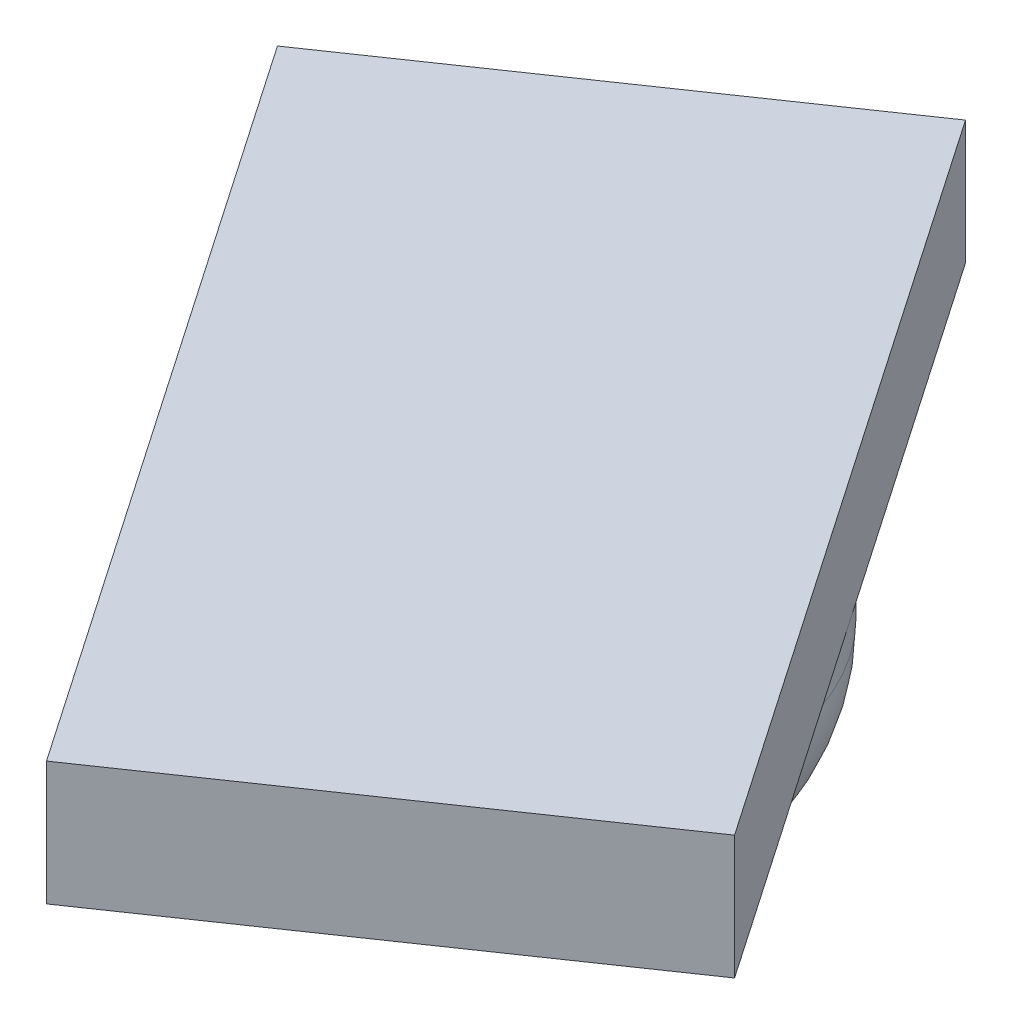
ISO-10303-21;
HEADER;
FILE_DESCRIPTION(('STEP AP214'),'2;1');
FILE_NAME('part.step','',(''),(''),'','','');
FILE_SCHEMA(('AUTOMOTIVE_DESIGN { 1 0 10303 214 1 1 1 1 }'));
ENDSEC;
DATA;
#1=APPLICATION_CONTEXT('core data for automotive mechanical design processes');
#2=APPLICATION_PROTOCOL_DEFINITION('international standard','automotive_design',2000,#1);
#3=PRODUCT_CONTEXT('',#1,'mechanical');
#4=PRODUCT('Part','Part','',(#3));
#5=PRODUCT_RELATED_PRODUCT_CATEGORY('part','',(#4));
#6=PRODUCT_DEFINITION_FORMATION('','',#4);
#7=PRODUCT_DEFINITION_CONTEXT('part definition',#1,'design');
#8=PRODUCT_DEFINITION('design','',#6,#7);
#9=PRODUCT_DEFINITION_SHAPE('','',#8);
#10=(LENGTH_UNIT() NAMED_UNIT(*) SI_UNIT(.MILLI.,.METRE.));
#11=(NAMED_UNIT(*) PLANE_ANGLE_UNIT() SI_UNIT($,.RADIAN.));
#12=(NAMED_UNIT(*) SI_UNIT($,.STERADIAN.) SOLID_ANGLE_UNIT());
#13=UNCERTAINTY_MEASURE_WITH_UNIT(LENGTH_MEASURE(1.E-05),#10,'distance_accuracy_value','');
#14=(GEOMETRIC_REPRESENTATION_CONTEXT(3) GLOBAL_UNCERTAINTY_ASSIGNED_CONTEXT((#13)) GLOBAL_UNIT_ASSIGNED_CONTEXT((#10,
#11,#12)) REPRESENTATION_CONTEXT('',''));
#15=CARTESIAN_POINT('',(0.,0.,0.));
#16=DIRECTION('',(0.,0.,1.));
#17=DIRECTION('',(1.,0.,0.));
#18=AXIS2_PLACEMENT_3D('',#15,#16,#17);
#19=CARTESIAN_POINT('',(0.,5.5,0.));
#20=DIRECTION('',(0.,-1.,0.));
#21=DIRECTION('',(0.,0.,-1.));
#22=AXIS2_PLACEMENT_3D('',#19,#20,#21);
#23=CYLINDRICAL_SURFACE('',#22,4.);
#24=CARTESIAN_POINT('',(0.,3.,0.));
#25=DIRECTION('',(0.,1.,0.));
#26=DIRECTION('',(0.,0.,1.));
#27=AXIS2_PLACEMENT_3D('',#24,#25,#26);
#28=CIRCLE('',#27,4.);
#29=CARTESIAN_POINT('',(0.,3.,4.));
#30=VERTEX_POINT('',#29);
#31=EDGE_CURVE('E41',#30,#30,#28,.T.);
#32=ORIENTED_EDGE('',*,*,#31,.T.);
#33=EDGE_LOOP('',(#32));
#34=FACE_BOUND('',#33,.T.);
#35=CARTESIAN_POINT('',(0.,3.5,0.));
#36=DIRECTION('',(0.,-1.,0.));
#37=DIRECTION('',(0.,0.,-1.));
#38=AXIS2_PLACEMENT_3D('',#35,#36,#37);
#39=CIRCLE('',#38,4.);
#40=CARTESIAN_POINT('',(-3.29899962771978,3.5,2.26199059598062));
#41=VERTEX_POINT('',#40);
#42=CARTESIAN_POINT('',(3.29899962771978,3.5,-2.26199059598062));
#43=VERTEX_POINT('',#42);
#44=EDGE_CURVE('E55',#41,#43,#39,.T.);
#45=ORIENTED_EDGE('',*,*,#44,.T.);
#46=EDGE_CURVE('E123',#43,#41,#39,.T.);
#47=ORIENTED_EDGE('',*,*,#46,.T.);
#48=EDGE_LOOP('',(#45,#47));
#49=FACE_BOUND('',#48,.T.);
#50=ADVANCED_FACE('F33',(#34,#49),#23,.T.);
#51=CARTESIAN_POINT('',(0.,0.,0.));
#52=DIRECTION('',(0.,1.,0.));
#53=DIRECTION('',(0.,0.,1.));
#54=AXIS2_PLACEMENT_3D('',#51,#52,#53);
#55=PLANE('',#54);
#56=CARTESIAN_POINT('',(0.,0.,0.));
#57=DIRECTION('',(0.,1.,0.));
#58=DIRECTION('',(0.,0.,1.));
#59=AXIS2_PLACEMENT_3D('',#56,#57,#58);
#60=CIRCLE('',#59,1.);
#61=CARTESIAN_POINT('',(0.,0.,1.));
#62=VERTEX_POINT('',#61);
#63=EDGE_CURVE('E11',#62,#62,#60,.F.);
#64=ORIENTED_EDGE('',*,*,#63,.T.);
#65=EDGE_LOOP('',(#64));
#66=FACE_BOUND('',#65,.T.);
#67=ADVANCED_FACE('F129',(#66),#55,.F.);
#68=CARTESIAN_POINT('',(0.,3.5,0.));
#69=DIRECTION('',(0.,-1.,0.));
#70=DIRECTION('',(0.,0.,-1.));
#71=AXIS2_PLACEMENT_3D('',#68,#69,#70);
#72=PLANE('',#71);
#73=ORIENTED_EDGE('',*,*,#46,.F.);
#74=DIRECTION('',(-0.565497648995155,0.,-0.824749906929945));
#75=VECTOR('',#74,1.);
#76=CARTESIAN_POINT('',(7.3705827004849,3.5,3.67620873391499));
#77=LINE('',#76,#75);
#78=CARTESIAN_POINT('',(7.3705827004849,3.5,3.67620873391499));
#79=VERTEX_POINT('',#78);
#80=EDGE_CURVE('E48',#79,#43,#77,.T.);
#81=ORIENTED_EDGE('',*,*,#80,.F.);
#82=DIRECTION('',(0.824749906929945,0.,-0.565497648995155));
#83=VECTOR('',#82,1.);
#84=CARTESIAN_POINT('',(0.772583445045335,3.5,8.20018992587623));
#85=LINE('',#84,#83);
#86=CARTESIAN_POINT('',(0.772583445045335,3.5,8.20018992587623));
#87=VERTEX_POINT('',#86);
#88=EDGE_CURVE('E96',#87,#79,#85,.T.);
#89=ORIENTED_EDGE('',*,*,#88,.F.);
#90=DIRECTION('',(0.565497648995155,0.,0.824749906929945));
#91=VECTOR('',#90,1.);
#92=CARTESIAN_POINT('',(0.772583445045335,3.5,8.20018992587623));
#93=LINE('',#92,#91);
#94=EDGE_CURVE('E81',#41,#87,#93,.T.);
#95=ORIENTED_EDGE('',*,*,#94,.F.);
#96=EDGE_LOOP('',(#73,#81,#89,#95));
#97=FACE_BOUND('',#96,.T.);
#98=ADVANCED_FACE('F102',(#97),#72,.T.);
#99=CARTESIAN_POINT('',(0.772583445045335,3.5,8.20018992587623));
#100=DIRECTION('',(-0.824749906929945,0.,0.565497648995155));
#101=DIRECTION('',(0.565497648995155,0.,0.824749906929945));
#102=AXIS2_PLACEMENT_3D('',#99,#100,#101);
#103=PLANE('',#102);
#104=CARTESIAN_POINT('',(-7.37058270048489,3.5,-3.67620873391498));
#105=VERTEX_POINT('',#104);
#106=EDGE_CURVE('E86',#105,#41,#93,.T.);
#107=ORIENTED_EDGE('',*,*,#106,.T.);
#108=ORIENTED_EDGE('',*,*,#94,.T.);
#109=DIRECTION('',(0.,1.,0.));
#110=VECTOR('',#109,1.);
#111=CARTESIAN_POINT('',(0.772583445045335,3.5,8.20018992587623));
#112=LINE('',#111,#110);
#113=CARTESIAN_POINT('',(0.772583445045335,5.5,8.20018992587623));
#114=VERTEX_POINT('',#113);
#115=EDGE_CURVE('E84',#87,#114,#112,.T.);
#116=ORIENTED_EDGE('',*,*,#115,.T.);
#117=DIRECTION('',(0.565497648995155,0.,0.824749906929945));
#118=VECTOR('',#117,1.);
#119=CARTESIAN_POINT('',(0.772583445045335,5.5,8.20018992587623));
#120=LINE('',#119,#118);
#121=CARTESIAN_POINT('',(-7.37058270048489,5.5,-3.67620873391498));
#122=VERTEX_POINT('',#121);
#123=EDGE_CURVE('E109',#122,#114,#120,.T.);
#124=ORIENTED_EDGE('',*,*,#123,.F.);
#125=DIRECTION('',(0.,1.,0.));
#126=VECTOR('',#125,1.);
#127=CARTESIAN_POINT('',(-7.37058270048489,3.5,-3.67620873391498));
#128=LINE('',#127,#126);
#129=EDGE_CURVE('E116',#105,#122,#128,.T.);
#130=ORIENTED_EDGE('',*,*,#129,.F.);
#131=EDGE_LOOP('',(#107,#108,#116,#124,#130));
#132=FACE_BOUND('',#131,.T.);
#133=ADVANCED_FACE('F83',(#132),#103,.T.);
#134=CARTESIAN_POINT('',(7.3705827004849,3.5,3.67620873391499));
#135=DIRECTION('',(0.824749906929945,0.,-0.565497648995155));
#136=DIRECTION('',(-0.565497648995155,0.,-0.824749906929945));
#137=AXIS2_PLACEMENT_3D('',#134,#135,#136);
#138=PLANE('',#137);
#139=ORIENTED_EDGE('',*,*,#80,.T.);
#140=CARTESIAN_POINT('',(-0.772583445045333,3.5,-8.20018992587622));
#141=VERTEX_POINT('',#140);
#142=EDGE_CURVE('E103',#43,#141,#77,.T.);
#143=ORIENTED_EDGE('',*,*,#142,.T.);
#144=DIRECTION('',(0.,1.,0.));
#145=VECTOR('',#144,1.);
#146=CARTESIAN_POINT('',(-0.772583445045333,3.5,-8.20018992587622));
#147=LINE('',#146,#145);
#148=CARTESIAN_POINT('',(-0.772583445045333,5.5,-8.20018992587622));
#149=VERTEX_POINT('',#148);
#150=EDGE_CURVE('E119',#141,#149,#147,.T.);
#151=ORIENTED_EDGE('',*,*,#150,.T.);
#152=DIRECTION('',(-0.565497648995155,0.,-0.824749906929945));
#153=VECTOR('',#152,1.);
#154=CARTESIAN_POINT('',(7.3705827004849,5.5,3.67620873391499));
#155=LINE('',#154,#153);
#156=CARTESIAN_POINT('',(7.3705827004849,5.5,3.67620873391499));
#157=VERTEX_POINT('',#156);
#158=EDGE_CURVE('E112',#157,#149,#155,.T.);
#159=ORIENTED_EDGE('',*,*,#158,.F.);
#160=DIRECTION('',(0.,1.,0.));
#161=VECTOR('',#160,1.);
#162=CARTESIAN_POINT('',(7.3705827004849,3.5,3.67620873391499));
#163=LINE('',#162,#161);
#164=EDGE_CURVE('E99',#79,#157,#163,.T.);
#165=ORIENTED_EDGE('',*,*,#164,.F.);
#166=EDGE_LOOP('',(#139,#143,#151,#159,#165));
#167=FACE_BOUND('',#166,.T.);
#168=ADVANCED_FACE('F143',(#167),#138,.T.);
#169=CARTESIAN_POINT('',(-7.37058270048489,3.5,-3.67620873391498));
#170=DIRECTION('',(-0.565497648995154,0.,-0.824749906929945));
#171=DIRECTION('',(-0.824749906929945,0.,0.565497648995154));
#172=AXIS2_PLACEMENT_3D('',#169,#170,#171);
#173=PLANE('',#172);
#174=DIRECTION('',(-0.824749906929945,0.,0.565497648995154));
#175=VECTOR('',#174,1.);
#176=CARTESIAN_POINT('',(-7.37058270048489,5.5,-3.67620873391498));
#177=LINE('',#176,#175);
#178=EDGE_CURVE('E91',#149,#122,#177,.T.);
#179=ORIENTED_EDGE('',*,*,#178,.F.);
#180=ORIENTED_EDGE('',*,*,#150,.F.);
#181=DIRECTION('',(-0.824749906929945,0.,0.565497648995154));
#182=VECTOR('',#181,1.);
#183=CARTESIAN_POINT('',(-7.37058270048489,3.5,-3.67620873391498));
#184=LINE('',#183,#182);
#185=EDGE_CURVE('E100',#141,#105,#184,.T.);
#186=ORIENTED_EDGE('',*,*,#185,.T.);
#187=ORIENTED_EDGE('',*,*,#129,.T.);
#188=EDGE_LOOP('',(#179,#180,#186,#187));
#189=FACE_BOUND('',#188,.T.);
#190=ADVANCED_FACE('F146',(#189),#173,.T.);
#191=CARTESIAN_POINT('',(0.772583445045335,3.5,8.20018992587623));
#192=DIRECTION('',(0.565497648995155,0.,0.824749906929945));
#193=DIRECTION('',(0.824749906929945,0.,-0.565497648995155));
#194=AXIS2_PLACEMENT_3D('',#191,#192,#193);
#195=PLANE('',#194);
#196=DIRECTION('',(0.824749906929945,0.,-0.565497648995155));
#197=VECTOR('',#196,1.);
#198=CARTESIAN_POINT('',(0.772583445045335,5.5,8.20018992587623));
#199=LINE('',#198,#197);
#200=EDGE_CURVE('E98',#114,#157,#199,.T.);
#201=ORIENTED_EDGE('',*,*,#200,.F.);
#202=ORIENTED_EDGE('',*,*,#115,.F.);
#203=ORIENTED_EDGE('',*,*,#88,.T.);
#204=ORIENTED_EDGE('',*,*,#164,.T.);
#205=EDGE_LOOP('',(#201,#202,#203,#204));
#206=FACE_BOUND('',#205,.T.);
#207=ADVANCED_FACE('F95',(#206),#195,.T.);
#208=ORIENTED_EDGE('',*,*,#44,.F.);
#209=ORIENTED_EDGE('',*,*,#106,.F.);
#210=ORIENTED_EDGE('',*,*,#185,.F.);
#211=ORIENTED_EDGE('',*,*,#142,.F.);
#212=EDGE_LOOP('',(#208,#209,#210,#211));
#213=FACE_BOUND('',#212,.T.);
#214=ADVANCED_FACE('F139',(#213),#72,.T.);
#215=CARTESIAN_POINT('',(0.,5.5,0.));
#216=DIRECTION('',(0.,1.,0.));
#217=DIRECTION('',(0.,0.,1.));
#218=AXIS2_PLACEMENT_3D('',#215,#216,#217);
#219=PLANE('',#218);
#220=ORIENTED_EDGE('',*,*,#178,.T.);
#221=ORIENTED_EDGE('',*,*,#123,.T.);
#222=ORIENTED_EDGE('',*,*,#200,.T.);
#223=ORIENTED_EDGE('',*,*,#158,.T.);
#224=EDGE_LOOP('',(#220,#221,#222,#223));
#225=FACE_BOUND('',#224,.T.);
#226=ADVANCED_FACE('F136',(#225),#219,.T.);
#227=CARTESIAN_POINT('',(0.,3.,0.));
#228=DIRECTION('',(0.,1.,0.));
#229=DIRECTION('',(0.,0.,1.));
#230=AXIS2_PLACEMENT_3D('',#227,#228,#229);
#231=DEGENERATE_TOROIDAL_SURFACE('',#230,1.,3.,.T.);
#232=ORIENTED_EDGE('',*,*,#63,.F.);
#233=EDGE_LOOP('',(#232));
#234=FACE_BOUND('',#233,.T.);
#235=ORIENTED_EDGE('',*,*,#31,.F.);
#236=EDGE_LOOP('',(#235));
#237=FACE_BOUND('',#236,.T.);
#238=ADVANCED_FACE('F35',(#234,#237),#231,.T.);
#239=CLOSED_SHELL('',(#50,#67,#98,#133,#168,#190,#207,#214,#226,#238));
#240=MANIFOLD_SOLID_BREP('B2',#239);
#241=ADVANCED_BREP_SHAPE_REPRESENTATION('',(#18,#240),#14);
#242=SHAPE_DEFINITION_REPRESENTATION(#9,#241);
ENDSEC;
END-ISO-10303-21;
